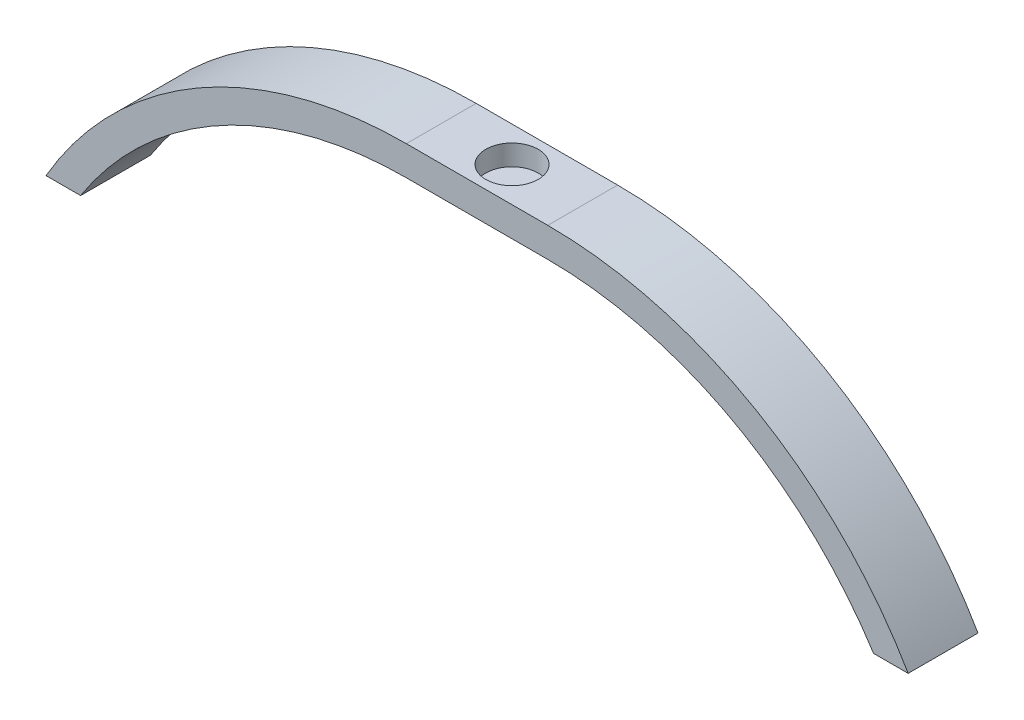
ISO-10303-21;
HEADER;
FILE_DESCRIPTION(('STEP AP214'),'2;1');
FILE_NAME('part.step','',(''),(''),'','','');
FILE_SCHEMA(('AUTOMOTIVE_DESIGN { 1 0 10303 214 1 1 1 1 }'));
ENDSEC;
DATA;
#1=APPLICATION_CONTEXT('core data for automotive mechanical design processes');
#2=APPLICATION_PROTOCOL_DEFINITION('international standard','automotive_design',2000,#1);
#3=PRODUCT_CONTEXT('',#1,'mechanical');
#4=PRODUCT('Part','Part','',(#3));
#5=PRODUCT_RELATED_PRODUCT_CATEGORY('part','',(#4));
#6=PRODUCT_DEFINITION_FORMATION('','',#4);
#7=PRODUCT_DEFINITION_CONTEXT('part definition',#1,'design');
#8=PRODUCT_DEFINITION('design','',#6,#7);
#9=PRODUCT_DEFINITION_SHAPE('','',#8);
#10=(LENGTH_UNIT() NAMED_UNIT(*) SI_UNIT(.MILLI.,.METRE.));
#11=(NAMED_UNIT(*) PLANE_ANGLE_UNIT() SI_UNIT($,.RADIAN.));
#12=(NAMED_UNIT(*) SI_UNIT($,.STERADIAN.) SOLID_ANGLE_UNIT());
#13=UNCERTAINTY_MEASURE_WITH_UNIT(LENGTH_MEASURE(1.E-05),#10,'distance_accuracy_value','');
#14=(GEOMETRIC_REPRESENTATION_CONTEXT(3) GLOBAL_UNCERTAINTY_ASSIGNED_CONTEXT((#13)) GLOBAL_UNIT_ASSIGNED_CONTEXT((#10,
#11,#12)) REPRESENTATION_CONTEXT('',''));
#15=CARTESIAN_POINT('',(0.,0.,0.));
#16=DIRECTION('',(0.,0.,1.));
#17=DIRECTION('',(1.,0.,0.));
#18=AXIS2_PLACEMENT_3D('',#15,#16,#17);
#19=CARTESIAN_POINT('',(-10.2908478004849,0.,10.16));
#20=DIRECTION('',(0.,0.,-1.));
#21=DIRECTION('',(-1.,0.,0.));
#22=AXIS2_PLACEMENT_3D('',#19,#20,#21);
#23=CYLINDRICAL_SURFACE('',#22,60.57);
#24=CARTESIAN_POINT('',(-10.2908478004849,0.,0.));
#25=DIRECTION('',(0.,0.,1.));
#26=DIRECTION('',(1.,0.,0.));
#27=AXIS2_PLACEMENT_3D('',#24,#25,#26);
#28=CIRCLE('',#27,60.57);
#29=CARTESIAN_POINT('',(-10.29,60.5699999940667,0.));
#30=VERTEX_POINT('',#29);
#31=CARTESIAN_POINT('',(-62.72,30.3299999940667,0.));
#32=VERTEX_POINT('',#31);
#33=EDGE_CURVE('E146',#30,#32,#28,.T.);
#34=ORIENTED_EDGE('',*,*,#33,.T.);
#35=DIRECTION('',(0.,0.,-1.));
#36=VECTOR('',#35,1.);
#37=CARTESIAN_POINT('',(-62.72,30.3299999940667,10.16));
#38=LINE('',#37,#36);
#39=CARTESIAN_POINT('',(-62.72,30.3299999940667,10.16));
#40=VERTEX_POINT('',#39);
#41=EDGE_CURVE('E11',#40,#32,#38,.T.);
#42=ORIENTED_EDGE('',*,*,#41,.F.);
#43=CARTESIAN_POINT('',(-10.2908478004849,0.,10.16));
#44=DIRECTION('',(0.,0.,1.));
#45=DIRECTION('',(1.,0.,0.));
#46=AXIS2_PLACEMENT_3D('',#43,#44,#45);
#47=CIRCLE('',#46,60.57);
#48=CARTESIAN_POINT('',(-10.29,60.5699999940667,10.16));
#49=VERTEX_POINT('',#48);
#50=EDGE_CURVE('E169',#49,#40,#47,.T.);
#51=ORIENTED_EDGE('',*,*,#50,.F.);
#52=DIRECTION('',(0.,0.,-1.));
#53=VECTOR('',#52,1.);
#54=CARTESIAN_POINT('',(-10.29,60.5699999940667,10.16));
#55=LINE('',#54,#53);
#56=EDGE_CURVE('E142',#49,#30,#55,.T.);
#57=ORIENTED_EDGE('',*,*,#56,.T.);
#58=EDGE_LOOP('',(#34,#42,#51,#57));
#59=FACE_BOUND('',#58,.T.);
#60=ADVANCED_FACE('F45',(#59),#23,.T.);
#61=CARTESIAN_POINT('',(-62.72,30.3299999940667,10.16));
#62=DIRECTION('',(0.,1.,0.));
#63=DIRECTION('',(0.,0.,1.));
#64=AXIS2_PLACEMENT_3D('',#61,#62,#63);
#65=PLANE('',#64);
#66=DIRECTION('',(1.,0.,0.));
#67=VECTOR('',#66,1.);
#68=CARTESIAN_POINT('',(-62.72,30.3299999940667,0.));
#69=LINE('',#68,#67);
#70=CARTESIAN_POINT('',(-57.6870923813443,30.3299999941256,0.));
#71=VERTEX_POINT('',#70);
#72=EDGE_CURVE('E150',#32,#71,#69,.T.);
#73=ORIENTED_EDGE('',*,*,#72,.T.);
#74=DIRECTION('',(0.,0.,-1.));
#75=VECTOR('',#74,1.);
#76=CARTESIAN_POINT('',(-57.6870923813443,30.3299999941256,10.16));
#77=LINE('',#76,#75);
#78=CARTESIAN_POINT('',(-57.6870923813443,30.3299999941256,10.16));
#79=VERTEX_POINT('',#78);
#80=EDGE_CURVE('E54',#79,#71,#77,.T.);
#81=ORIENTED_EDGE('',*,*,#80,.F.);
#82=DIRECTION('',(1.,0.,0.));
#83=VECTOR('',#82,1.);
#84=CARTESIAN_POINT('',(-62.72,30.3299999940667,10.16));
#85=LINE('',#84,#83);
#86=EDGE_CURVE('E105',#40,#79,#85,.T.);
#87=ORIENTED_EDGE('',*,*,#86,.F.);
#88=ORIENTED_EDGE('',*,*,#41,.T.);
#89=EDGE_LOOP('',(#73,#81,#87,#88));
#90=FACE_BOUND('',#89,.T.);
#91=ADVANCED_FACE('F241',(#90),#65,.F.);
#92=CARTESIAN_POINT('',(-10.2908478004849,0.,10.16));
#93=DIRECTION('',(0.,0.,-1.));
#94=DIRECTION('',(-1.,0.,0.));
#95=AXIS2_PLACEMENT_3D('',#92,#93,#94);
#96=CYLINDRICAL_SURFACE('',#95,56.2700000001093);
#97=CARTESIAN_POINT('',(-10.2908478004849,0.,0.));
#98=DIRECTION('',(0.,0.,-1.));
#99=DIRECTION('',(1.,0.,0.));
#100=AXIS2_PLACEMENT_3D('',#97,#98,#99);
#101=CIRCLE('',#100,56.2700000001093);
#102=CARTESIAN_POINT('',(-10.2900300936279,56.2699999942773,0.));
#103=VERTEX_POINT('',#102);
#104=EDGE_CURVE('E154',#71,#103,#101,.T.);
#105=ORIENTED_EDGE('',*,*,#104,.T.);
#106=DIRECTION('',(0.,0.,-1.));
#107=VECTOR('',#106,1.);
#108=CARTESIAN_POINT('',(-10.2900300936279,56.2699999942773,10.16));
#109=LINE('',#108,#107);
#110=CARTESIAN_POINT('',(-10.2900300936279,56.2699999942773,10.16));
#111=VERTEX_POINT('',#110);
#112=EDGE_CURVE('E180',#111,#103,#109,.T.);
#113=ORIENTED_EDGE('',*,*,#112,.F.);
#114=CARTESIAN_POINT('',(-10.2908478004849,0.,10.16));
#115=DIRECTION('',(0.,0.,-1.));
#116=DIRECTION('',(1.,0.,0.));
#117=AXIS2_PLACEMENT_3D('',#114,#115,#116);
#118=CIRCLE('',#117,56.2700000001093);
#119=EDGE_CURVE('E190',#79,#111,#118,.T.);
#120=ORIENTED_EDGE('',*,*,#119,.F.);
#121=ORIENTED_EDGE('',*,*,#80,.T.);
#122=EDGE_LOOP('',(#105,#113,#120,#121));
#123=FACE_BOUND('',#122,.T.);
#124=ADVANCED_FACE('F188',(#123),#96,.F.);
#125=CARTESIAN_POINT('',(-10.2900300936279,56.2699999942773,10.16));
#126=DIRECTION('',(0.,1.,0.));
#127=DIRECTION('',(0.,0.,1.));
#128=AXIS2_PLACEMENT_3D('',#125,#126,#127);
#129=PLANE('',#128);
#130=DIRECTION('',(1.,0.,0.));
#131=VECTOR('',#130,1.);
#132=CARTESIAN_POINT('',(-10.2900300936279,56.2699999942773,0.));
#133=LINE('',#132,#131);
#134=CARTESIAN_POINT('',(10.2900300936279,56.2699999941679,0.));
#135=VERTEX_POINT('',#134);
#136=EDGE_CURVE('E157',#103,#135,#133,.T.);
#137=ORIENTED_EDGE('',*,*,#136,.T.);
#138=DIRECTION('',(0.,0.,-1.));
#139=VECTOR('',#138,1.);
#140=CARTESIAN_POINT('',(10.2900300936279,56.2699999941679,10.16));
#141=LINE('',#140,#139);
#142=CARTESIAN_POINT('',(10.2900300936279,56.2699999941679,10.16));
#143=VERTEX_POINT('',#142);
#144=EDGE_CURVE('E176',#143,#135,#141,.T.);
#145=ORIENTED_EDGE('',*,*,#144,.F.);
#146=DIRECTION('',(1.,0.,0.));
#147=VECTOR('',#146,1.);
#148=CARTESIAN_POINT('',(-10.2900300936279,56.2699999942773,10.16));
#149=LINE('',#148,#147);
#150=EDGE_CURVE('E203',#111,#143,#149,.T.);
#151=ORIENTED_EDGE('',*,*,#150,.F.);
#152=ORIENTED_EDGE('',*,*,#112,.T.);
#153=EDGE_LOOP('',(#137,#145,#151,#152));
#154=FACE_BOUND('',#153,.T.);
#155=ADVANCED_FACE('F198',(#154),#129,.F.);
#156=CARTESIAN_POINT('',(10.2908478004849,0.,10.16));
#157=DIRECTION('',(0.,0.,-1.));
#158=DIRECTION('',(-1.,0.,0.));
#159=AXIS2_PLACEMENT_3D('',#156,#157,#158);
#160=CYLINDRICAL_SURFACE('',#159,56.2700000001093);
#161=CARTESIAN_POINT('',(10.2908478004849,0.,0.));
#162=DIRECTION('',(0.,0.,-1.));
#163=DIRECTION('',(1.,0.,0.));
#164=AXIS2_PLACEMENT_3D('',#161,#162,#163);
#165=CIRCLE('',#164,56.2700000001093);
#166=CARTESIAN_POINT('',(57.6870923812522,30.3299999940667,0.));
#167=VERTEX_POINT('',#166);
#168=EDGE_CURVE('E160',#135,#167,#165,.T.);
#169=ORIENTED_EDGE('',*,*,#168,.T.);
#170=DIRECTION('',(0.,0.,-1.));
#171=VECTOR('',#170,1.);
#172=CARTESIAN_POINT('',(57.6870923812522,30.3299999940667,10.16));
#173=LINE('',#172,#171);
#174=CARTESIAN_POINT('',(57.6870923812522,30.3299999940667,10.16));
#175=VERTEX_POINT('',#174);
#176=EDGE_CURVE('E135',#175,#167,#173,.T.);
#177=ORIENTED_EDGE('',*,*,#176,.F.);
#178=CARTESIAN_POINT('',(10.2908478004849,0.,10.16));
#179=DIRECTION('',(0.,0.,-1.));
#180=DIRECTION('',(1.,0.,0.));
#181=AXIS2_PLACEMENT_3D('',#178,#179,#180);
#182=CIRCLE('',#181,56.2700000001093);
#183=EDGE_CURVE('E124',#143,#175,#182,.T.);
#184=ORIENTED_EDGE('',*,*,#183,.F.);
#185=ORIENTED_EDGE('',*,*,#144,.T.);
#186=EDGE_LOOP('',(#169,#177,#184,#185));
#187=FACE_BOUND('',#186,.T.);
#188=ADVANCED_FACE('F201',(#187),#160,.F.);
#189=CARTESIAN_POINT('',(62.72,30.3299999940667,10.16));
#190=DIRECTION('',(0.,1.,0.));
#191=DIRECTION('',(0.,0.,1.));
#192=AXIS2_PLACEMENT_3D('',#189,#190,#191);
#193=PLANE('',#192);
#194=DIRECTION('',(1.,0.,0.));
#195=VECTOR('',#194,1.);
#196=CARTESIAN_POINT('',(62.72,30.3299999940667,0.));
#197=LINE('',#196,#195);
#198=CARTESIAN_POINT('',(62.72,30.3299999940667,0.));
#199=VERTEX_POINT('',#198);
#200=EDGE_CURVE('E133',#167,#199,#197,.T.);
#201=ORIENTED_EDGE('',*,*,#200,.T.);
#202=DIRECTION('',(0.,0.,-1.));
#203=VECTOR('',#202,1.);
#204=CARTESIAN_POINT('',(62.72,30.3299999940667,10.16));
#205=LINE('',#204,#203);
#206=CARTESIAN_POINT('',(62.72,30.3299999940667,10.16));
#207=VERTEX_POINT('',#206);
#208=EDGE_CURVE('E130',#207,#199,#205,.T.);
#209=ORIENTED_EDGE('',*,*,#208,.F.);
#210=DIRECTION('',(1.,0.,0.));
#211=VECTOR('',#210,1.);
#212=CARTESIAN_POINT('',(62.72,30.3299999940667,10.16));
#213=LINE('',#212,#211);
#214=EDGE_CURVE('E118',#175,#207,#213,.T.);
#215=ORIENTED_EDGE('',*,*,#214,.F.);
#216=ORIENTED_EDGE('',*,*,#176,.T.);
#217=EDGE_LOOP('',(#201,#209,#215,#216));
#218=FACE_BOUND('',#217,.T.);
#219=ADVANCED_FACE('F131',(#218),#193,.F.);
#220=CARTESIAN_POINT('',(10.2908478004849,0.,10.16));
#221=DIRECTION('',(0.,0.,-1.));
#222=DIRECTION('',(-1.,0.,0.));
#223=AXIS2_PLACEMENT_3D('',#220,#221,#222);
#224=CYLINDRICAL_SURFACE('',#223,60.57);
#225=CARTESIAN_POINT('',(10.2908478004849,0.,0.));
#226=DIRECTION('',(0.,0.,1.));
#227=DIRECTION('',(1.,0.,0.));
#228=AXIS2_PLACEMENT_3D('',#225,#226,#227);
#229=CIRCLE('',#228,60.57);
#230=CARTESIAN_POINT('',(10.29,60.5699999940667,0.));
#231=VERTEX_POINT('',#230);
#232=EDGE_CURVE('E91',#199,#231,#229,.T.);
#233=ORIENTED_EDGE('',*,*,#232,.T.);
#234=DIRECTION('',(0.,0.,-1.));
#235=VECTOR('',#234,1.);
#236=CARTESIAN_POINT('',(10.29,60.5699999940667,10.16));
#237=LINE('',#236,#235);
#238=CARTESIAN_POINT('',(10.29,60.5699999940667,10.16));
#239=VERTEX_POINT('',#238);
#240=EDGE_CURVE('E136',#239,#231,#237,.T.);
#241=ORIENTED_EDGE('',*,*,#240,.F.);
#242=CARTESIAN_POINT('',(10.2908478004849,0.,10.16));
#243=DIRECTION('',(0.,0.,1.));
#244=DIRECTION('',(1.,0.,0.));
#245=AXIS2_PLACEMENT_3D('',#242,#243,#244);
#246=CIRCLE('',#245,60.57);
#247=EDGE_CURVE('E122',#207,#239,#246,.T.);
#248=ORIENTED_EDGE('',*,*,#247,.F.);
#249=ORIENTED_EDGE('',*,*,#208,.T.);
#250=EDGE_LOOP('',(#233,#241,#248,#249));
#251=FACE_BOUND('',#250,.T.);
#252=ADVANCED_FACE('F138',(#251),#224,.T.);
#253=CARTESIAN_POINT('',(-10.29,60.5699999940667,10.16));
#254=DIRECTION('',(0.,-1.,0.));
#255=DIRECTION('',(0.,0.,-1.));
#256=AXIS2_PLACEMENT_3D('',#253,#254,#255);
#257=PLANE('',#256);
#258=CARTESIAN_POINT('',(0.,60.5699999940667,5.08));
#259=DIRECTION('',(0.,1.,0.));
#260=DIRECTION('',(0.,0.,1.));
#261=AXIS2_PLACEMENT_3D('',#258,#259,#260);
#262=CIRCLE('',#261,3.81);
#263=CARTESIAN_POINT('',(0.,60.5699999940667,8.89));
#264=VERTEX_POINT('',#263);
#265=EDGE_CURVE('E213',#264,#264,#262,.T.);
#266=ORIENTED_EDGE('',*,*,#265,.F.);
#267=EDGE_LOOP('',(#266));
#268=FACE_BOUND('',#267,.T.);
#269=DIRECTION('',(-1.,0.,0.));
#270=VECTOR('',#269,1.);
#271=CARTESIAN_POINT('',(-10.29,60.5699999940667,0.));
#272=LINE('',#271,#270);
#273=EDGE_CURVE('E97',#231,#30,#272,.T.);
#274=ORIENTED_EDGE('',*,*,#273,.T.);
#275=ORIENTED_EDGE('',*,*,#56,.F.);
#276=DIRECTION('',(-1.,0.,0.));
#277=VECTOR('',#276,1.);
#278=CARTESIAN_POINT('',(-10.29,60.5699999940667,10.16));
#279=LINE('',#278,#277);
#280=EDGE_CURVE('E62',#239,#49,#279,.T.);
#281=ORIENTED_EDGE('',*,*,#280,.F.);
#282=ORIENTED_EDGE('',*,*,#240,.T.);
#283=EDGE_LOOP('',(#274,#275,#281,#282));
#284=FACE_BOUND('',#283,.T.);
#285=ADVANCED_FACE('F229',(#268,#284),#257,.F.);
#286=CARTESIAN_POINT('',(-10.2908478004849,0.,10.16));
#287=DIRECTION('',(0.,0.,1.));
#288=DIRECTION('',(1.,0.,0.));
#289=AXIS2_PLACEMENT_3D('',#286,#287,#288);
#290=PLANE('',#289);
#291=ORIENTED_EDGE('',*,*,#50,.T.);
#292=ORIENTED_EDGE('',*,*,#86,.T.);
#293=ORIENTED_EDGE('',*,*,#119,.T.);
#294=ORIENTED_EDGE('',*,*,#150,.T.);
#295=ORIENTED_EDGE('',*,*,#183,.T.);
#296=ORIENTED_EDGE('',*,*,#214,.T.);
#297=ORIENTED_EDGE('',*,*,#247,.T.);
#298=ORIENTED_EDGE('',*,*,#280,.T.);
#299=EDGE_LOOP('',(#291,#292,#293,#294,#295,#296,#297,#298));
#300=FACE_BOUND('',#299,.T.);
#301=ADVANCED_FACE('F120',(#300),#290,.T.);
#302=CARTESIAN_POINT('',(-10.2908478004849,0.,0.));
#303=DIRECTION('',(0.,0.,1.));
#304=DIRECTION('',(1.,0.,0.));
#305=AXIS2_PLACEMENT_3D('',#302,#303,#304);
#306=PLANE('',#305);
#307=ORIENTED_EDGE('',*,*,#33,.F.);
#308=ORIENTED_EDGE('',*,*,#273,.F.);
#309=ORIENTED_EDGE('',*,*,#232,.F.);
#310=ORIENTED_EDGE('',*,*,#200,.F.);
#311=ORIENTED_EDGE('',*,*,#168,.F.);
#312=ORIENTED_EDGE('',*,*,#136,.F.);
#313=ORIENTED_EDGE('',*,*,#104,.F.);
#314=ORIENTED_EDGE('',*,*,#72,.F.);
#315=EDGE_LOOP('',(#307,#308,#309,#310,#311,#312,#313,#314));
#316=FACE_BOUND('',#315,.T.);
#317=ADVANCED_FACE('F194',(#316),#306,.F.);
#318=CARTESIAN_POINT('',(0.,57.5699999940667,5.08));
#319=DIRECTION('',(0.,1.,0.));
#320=DIRECTION('',(0.,0.,1.));
#321=AXIS2_PLACEMENT_3D('',#318,#319,#320);
#322=CYLINDRICAL_SURFACE('',#321,3.81);
#323=CARTESIAN_POINT('',(0.,57.5699999940667,5.08));
#324=DIRECTION('',(0.,1.,0.));
#325=DIRECTION('',(0.,0.,1.));
#326=AXIS2_PLACEMENT_3D('',#323,#324,#325);
#327=CIRCLE('',#326,3.81);
#328=CARTESIAN_POINT('',(0.,57.5699999940667,8.89));
#329=VERTEX_POINT('',#328);
#330=EDGE_CURVE('E151',#329,#329,#327,.T.);
#331=ORIENTED_EDGE('',*,*,#330,.F.);
#332=EDGE_LOOP('',(#331));
#333=FACE_BOUND('',#332,.T.);
#334=ORIENTED_EDGE('',*,*,#265,.T.);
#335=EDGE_LOOP('',(#334));
#336=FACE_BOUND('',#335,.T.);
#337=ADVANCED_FACE('F223',(#333,#336),#322,.F.);
#338=CARTESIAN_POINT('',(0.,57.5699999940667,5.08));
#339=DIRECTION('',(0.,1.,0.));
#340=DIRECTION('',(0.,0.,1.));
#341=AXIS2_PLACEMENT_3D('',#338,#339,#340);
#342=PLANE('',#341);
#343=ORIENTED_EDGE('',*,*,#330,.T.);
#344=EDGE_LOOP('',(#343));
#345=FACE_BOUND('',#344,.T.);
#346=ADVANCED_FACE('F221',(#345),#342,.T.);
#347=CLOSED_SHELL('',(#60,#91,#124,#155,#188,#219,#252,#285,#301,#317,#337,#346));
#348=MANIFOLD_SOLID_BREP('B2',#347);
#349=ADVANCED_BREP_SHAPE_REPRESENTATION('',(#18,#348),#14);
#350=SHAPE_DEFINITION_REPRESENTATION(#9,#349);
ENDSEC;
END-ISO-10303-21;
